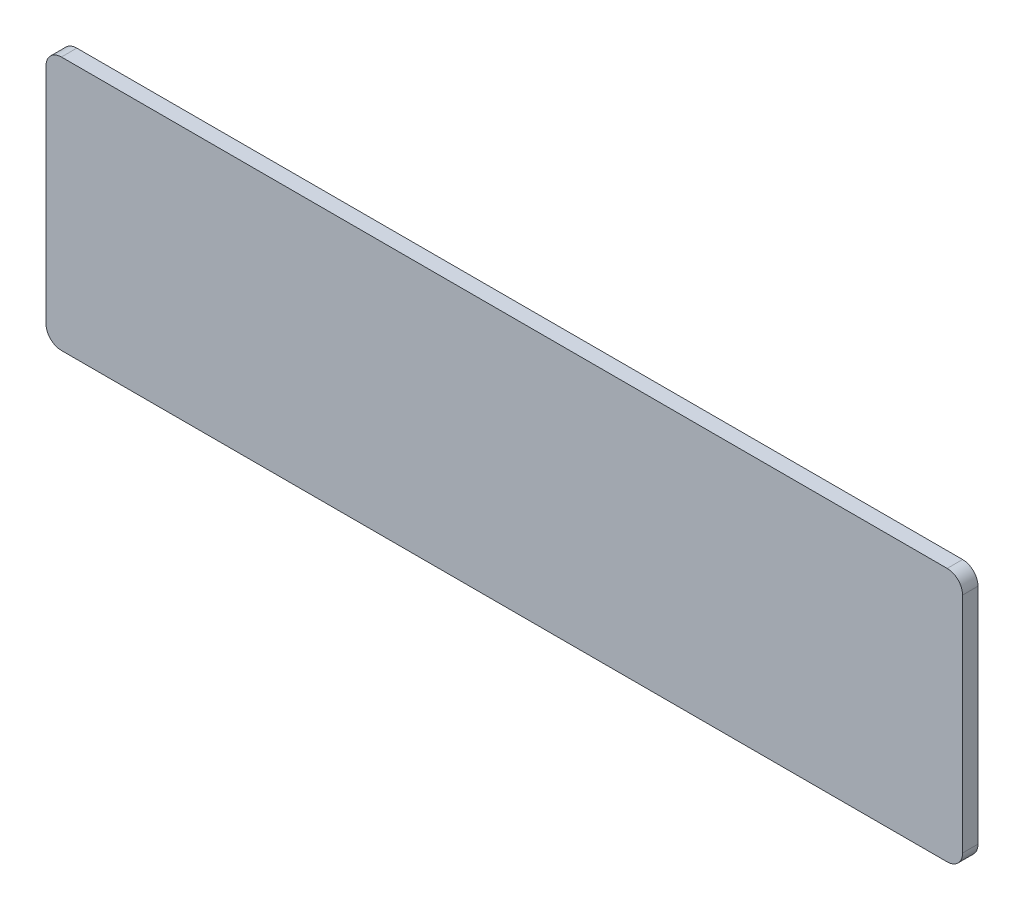
ISO-10303-21;
HEADER;
FILE_DESCRIPTION(('STEP AP214'),'2;1');
FILE_NAME('part.step','',(''),(''),'','','');
FILE_SCHEMA(('AUTOMOTIVE_DESIGN { 1 0 10303 214 1 1 1 1 }'));
ENDSEC;
DATA;
#1=APPLICATION_CONTEXT('core data for automotive mechanical design processes');
#2=APPLICATION_PROTOCOL_DEFINITION('international standard','automotive_design',2000,#1);
#3=PRODUCT_CONTEXT('',#1,'mechanical');
#4=PRODUCT('Part','Part','',(#3));
#5=PRODUCT_RELATED_PRODUCT_CATEGORY('part','',(#4));
#6=PRODUCT_DEFINITION_FORMATION('','',#4);
#7=PRODUCT_DEFINITION_CONTEXT('part definition',#1,'design');
#8=PRODUCT_DEFINITION('design','',#6,#7);
#9=PRODUCT_DEFINITION_SHAPE('','',#8);
#10=(LENGTH_UNIT() NAMED_UNIT(*) SI_UNIT(.MILLI.,.METRE.));
#11=(NAMED_UNIT(*) PLANE_ANGLE_UNIT() SI_UNIT($,.RADIAN.));
#12=(NAMED_UNIT(*) SI_UNIT($,.STERADIAN.) SOLID_ANGLE_UNIT());
#13=UNCERTAINTY_MEASURE_WITH_UNIT(LENGTH_MEASURE(1.E-05),#10,'distance_accuracy_value','');
#14=(GEOMETRIC_REPRESENTATION_CONTEXT(3) GLOBAL_UNCERTAINTY_ASSIGNED_CONTEXT((#13)) GLOBAL_UNIT_ASSIGNED_CONTEXT((#10,
#11,#12)) REPRESENTATION_CONTEXT('',''));
#15=CARTESIAN_POINT('',(0.,0.,0.));
#16=DIRECTION('',(0.,0.,1.));
#17=DIRECTION('',(1.,0.,0.));
#18=AXIS2_PLACEMENT_3D('',#15,#16,#17);
#19=CARTESIAN_POINT('',(57.5,-14.5,0.));
#20=DIRECTION('',(0.,0.,1.));
#21=DIRECTION('',(1.,0.,0.));
#22=AXIS2_PLACEMENT_3D('',#19,#20,#21);
#23=PLANE('',#22);
#24=CARTESIAN_POINT('',(57.5,-14.5,0.));
#25=DIRECTION('',(0.,0.,1.));
#26=DIRECTION('',(1.,0.,0.));
#27=AXIS2_PLACEMENT_3D('',#24,#25,#26);
#28=CIRCLE('',#27,2.);
#29=CARTESIAN_POINT('',(57.5,-16.5,0.));
#30=VERTEX_POINT('',#29);
#31=CARTESIAN_POINT('',(59.5,-14.5,0.));
#32=VERTEX_POINT('',#31);
#33=EDGE_CURVE('E167',#30,#32,#28,.T.);
#34=ORIENTED_EDGE('',*,*,#33,.F.);
#35=DIRECTION('',(1.,0.,0.));
#36=VECTOR('',#35,1.);
#37=CARTESIAN_POINT('',(-57.5,-16.5,0.));
#38=LINE('',#37,#36);
#39=CARTESIAN_POINT('',(-57.5,-16.5,0.));
#40=VERTEX_POINT('',#39);
#41=EDGE_CURVE('E180',#40,#30,#38,.T.);
#42=ORIENTED_EDGE('',*,*,#41,.F.);
#43=CARTESIAN_POINT('',(-57.5,-14.5,0.));
#44=DIRECTION('',(0.,0.,1.));
#45=DIRECTION('',(1.,0.,0.));
#46=AXIS2_PLACEMENT_3D('',#43,#44,#45);
#47=CIRCLE('',#46,2.00000000000002);
#48=CARTESIAN_POINT('',(-59.5,-14.5,0.));
#49=VERTEX_POINT('',#48);
#50=EDGE_CURVE('E204',#49,#40,#47,.T.);
#51=ORIENTED_EDGE('',*,*,#50,.F.);
#52=DIRECTION('',(0.,-1.,0.));
#53=VECTOR('',#52,1.);
#54=CARTESIAN_POINT('',(-59.5,14.5,0.));
#55=LINE('',#54,#53);
#56=CARTESIAN_POINT('',(-59.5,14.5,0.));
#57=VERTEX_POINT('',#56);
#58=EDGE_CURVE('E202',#57,#49,#55,.T.);
#59=ORIENTED_EDGE('',*,*,#58,.F.);
#60=CARTESIAN_POINT('',(-57.5,14.5,0.));
#61=DIRECTION('',(0.,0.,1.));
#62=DIRECTION('',(1.,0.,0.));
#63=AXIS2_PLACEMENT_3D('',#60,#61,#62);
#64=CIRCLE('',#63,2.00000000000002);
#65=CARTESIAN_POINT('',(-57.5,16.5,0.));
#66=VERTEX_POINT('',#65);
#67=EDGE_CURVE('E200',#66,#57,#64,.T.);
#68=ORIENTED_EDGE('',*,*,#67,.F.);
#69=DIRECTION('',(-1.,0.,0.));
#70=VECTOR('',#69,1.);
#71=CARTESIAN_POINT('',(57.5,16.5,0.));
#72=LINE('',#71,#70);
#73=CARTESIAN_POINT('',(57.5,16.5,0.));
#74=VERTEX_POINT('',#73);
#75=EDGE_CURVE('E198',#74,#66,#72,.T.);
#76=ORIENTED_EDGE('',*,*,#75,.F.);
#77=CARTESIAN_POINT('',(57.5,14.5,0.));
#78=DIRECTION('',(0.,0.,1.));
#79=DIRECTION('',(1.,0.,0.));
#80=AXIS2_PLACEMENT_3D('',#77,#78,#79);
#81=CIRCLE('',#80,2.);
#82=CARTESIAN_POINT('',(59.5,14.5,0.));
#83=VERTEX_POINT('',#82);
#84=EDGE_CURVE('E196',#83,#74,#81,.T.);
#85=ORIENTED_EDGE('',*,*,#84,.F.);
#86=DIRECTION('',(0.,1.,0.));
#87=VECTOR('',#86,1.);
#88=CARTESIAN_POINT('',(59.5,-14.5,0.));
#89=LINE('',#88,#87);
#90=EDGE_CURVE('E170',#32,#83,#89,.T.);
#91=ORIENTED_EDGE('',*,*,#90,.F.);
#92=EDGE_LOOP('',(#34,#42,#51,#59,#68,#76,#85,#91));
#93=FACE_BOUND('',#92,.T.);
#94=CARTESIAN_POINT('',(53.,9.99999999999998,0.));
#95=DIRECTION('',(0.,0.,-1.));
#96=DIRECTION('',(-1.,0.,0.));
#97=AXIS2_PLACEMENT_3D('',#94,#95,#96);
#98=CIRCLE('',#97,2.);
#99=CARTESIAN_POINT('',(53.,12.,0.));
#100=VERTEX_POINT('',#99);
#101=CARTESIAN_POINT('',(55.,9.99999999999997,0.));
#102=VERTEX_POINT('',#101);
#103=EDGE_CURVE('E49',#100,#102,#98,.T.);
#104=ORIENTED_EDGE('',*,*,#103,.F.);
#105=DIRECTION('',(1.,0.,0.));
#106=VECTOR('',#105,1.);
#107=CARTESIAN_POINT('',(-53.,12.,0.));
#108=LINE('',#107,#106);
#109=CARTESIAN_POINT('',(-53.,12.,0.));
#110=VERTEX_POINT('',#109);
#111=EDGE_CURVE('E53',#110,#100,#108,.T.);
#112=ORIENTED_EDGE('',*,*,#111,.F.);
#113=CARTESIAN_POINT('',(-53.,10.,0.));
#114=DIRECTION('',(0.,0.,-1.));
#115=DIRECTION('',(-1.,0.,0.));
#116=AXIS2_PLACEMENT_3D('',#113,#114,#115);
#117=CIRCLE('',#116,2.);
#118=CARTESIAN_POINT('',(-55.,9.99999999999998,0.));
#119=VERTEX_POINT('',#118);
#120=EDGE_CURVE('E430',#119,#110,#117,.T.);
#121=ORIENTED_EDGE('',*,*,#120,.F.);
#122=DIRECTION('',(0.,1.,0.));
#123=VECTOR('',#122,1.);
#124=CARTESIAN_POINT('',(-55.,-9.99999999999999,0.));
#125=LINE('',#124,#123);
#126=CARTESIAN_POINT('',(-55.,-9.99999999999999,0.));
#127=VERTEX_POINT('',#126);
#128=EDGE_CURVE('E464',#127,#119,#125,.T.);
#129=ORIENTED_EDGE('',*,*,#128,.F.);
#130=CARTESIAN_POINT('',(-53.,-10.,0.));
#131=DIRECTION('',(0.,0.,-1.));
#132=DIRECTION('',(-1.,0.,0.));
#133=AXIS2_PLACEMENT_3D('',#130,#131,#132);
#134=CIRCLE('',#133,2.);
#135=CARTESIAN_POINT('',(-53.,-12.,0.));
#136=VERTEX_POINT('',#135);
#137=EDGE_CURVE('E457',#136,#127,#134,.T.);
#138=ORIENTED_EDGE('',*,*,#137,.F.);
#139=DIRECTION('',(-1.,0.,0.));
#140=VECTOR('',#139,1.);
#141=CARTESIAN_POINT('',(-53.,-12.,0.));
#142=LINE('',#141,#140);
#143=CARTESIAN_POINT('',(53.,-12.,0.));
#144=VERTEX_POINT('',#143);
#145=EDGE_CURVE('E451',#144,#136,#142,.T.);
#146=ORIENTED_EDGE('',*,*,#145,.F.);
#147=CARTESIAN_POINT('',(53.,-10.,0.));
#148=DIRECTION('',(0.,0.,-1.));
#149=DIRECTION('',(1.,0.,0.));
#150=AXIS2_PLACEMENT_3D('',#147,#148,#149);
#151=CIRCLE('',#150,2.);
#152=CARTESIAN_POINT('',(55.,-10.,0.));
#153=VERTEX_POINT('',#152);
#154=EDGE_CURVE('E454',#153,#144,#151,.T.);
#155=ORIENTED_EDGE('',*,*,#154,.F.);
#156=DIRECTION('',(0.,-1.,0.));
#157=VECTOR('',#156,1.);
#158=CARTESIAN_POINT('',(55.,-10.,0.));
#159=LINE('',#158,#157);
#160=EDGE_CURVE('E455',#102,#153,#159,.T.);
#161=ORIENTED_EDGE('',*,*,#160,.F.);
#162=EDGE_LOOP('',(#104,#112,#121,#129,#138,#146,#155,#161));
#163=FACE_BOUND('',#162,.T.);
#164=ADVANCED_FACE('F34',(#93,#163),#23,.F.);
#165=CARTESIAN_POINT('',(57.5,-14.5,2.));
#166=DIRECTION('',(0.,0.,-1.));
#167=DIRECTION('',(-1.,0.,0.));
#168=AXIS2_PLACEMENT_3D('',#165,#166,#167);
#169=CYLINDRICAL_SURFACE('',#168,2.);
#170=ORIENTED_EDGE('',*,*,#33,.T.);
#171=DIRECTION('',(0.,0.,-1.));
#172=VECTOR('',#171,1.);
#173=CARTESIAN_POINT('',(59.5,-14.5,2.));
#174=LINE('',#173,#172);
#175=CARTESIAN_POINT('',(59.5,-14.5,2.));
#176=VERTEX_POINT('',#175);
#177=EDGE_CURVE('E11',#176,#32,#174,.T.);
#178=ORIENTED_EDGE('',*,*,#177,.F.);
#179=CARTESIAN_POINT('',(57.5,-14.5,2.));
#180=DIRECTION('',(0.,0.,1.));
#181=DIRECTION('',(1.,0.,0.));
#182=AXIS2_PLACEMENT_3D('',#179,#180,#181);
#183=CIRCLE('',#182,2.);
#184=CARTESIAN_POINT('',(57.5,-16.5,2.));
#185=VERTEX_POINT('',#184);
#186=EDGE_CURVE('E176',#185,#176,#183,.T.);
#187=ORIENTED_EDGE('',*,*,#186,.F.);
#188=DIRECTION('',(0.,0.,-1.));
#189=VECTOR('',#188,1.);
#190=CARTESIAN_POINT('',(57.5,-16.5,2.));
#191=LINE('',#190,#189);
#192=EDGE_CURVE('E193',#185,#30,#191,.T.);
#193=ORIENTED_EDGE('',*,*,#192,.T.);
#194=EDGE_LOOP('',(#170,#178,#187,#193));
#195=FACE_BOUND('',#194,.T.);
#196=ADVANCED_FACE('F36',(#195),#169,.T.);
#197=CARTESIAN_POINT('',(59.5,-14.5,2.));
#198=DIRECTION('',(-1.,0.,0.));
#199=DIRECTION('',(0.,0.,1.));
#200=AXIS2_PLACEMENT_3D('',#197,#198,#199);
#201=PLANE('',#200);
#202=ORIENTED_EDGE('',*,*,#90,.T.);
#203=DIRECTION('',(0.,0.,-1.));
#204=VECTOR('',#203,1.);
#205=CARTESIAN_POINT('',(59.5,14.5,2.));
#206=LINE('',#205,#204);
#207=CARTESIAN_POINT('',(59.5,14.5,2.));
#208=VERTEX_POINT('',#207);
#209=EDGE_CURVE('E42',#208,#83,#206,.T.);
#210=ORIENTED_EDGE('',*,*,#209,.F.);
#211=DIRECTION('',(0.,1.,0.));
#212=VECTOR('',#211,1.);
#213=CARTESIAN_POINT('',(59.5,-14.5,2.));
#214=LINE('',#213,#212);
#215=EDGE_CURVE('E179',#176,#208,#214,.T.);
#216=ORIENTED_EDGE('',*,*,#215,.F.);
#217=ORIENTED_EDGE('',*,*,#177,.T.);
#218=EDGE_LOOP('',(#202,#210,#216,#217));
#219=FACE_BOUND('',#218,.T.);
#220=ADVANCED_FACE('F250',(#219),#201,.F.);
#221=CARTESIAN_POINT('',(57.5,14.5,2.));
#222=DIRECTION('',(0.,0.,-1.));
#223=DIRECTION('',(-1.,0.,0.));
#224=AXIS2_PLACEMENT_3D('',#221,#222,#223);
#225=CYLINDRICAL_SURFACE('',#224,2.);
#226=ORIENTED_EDGE('',*,*,#84,.T.);
#227=DIRECTION('',(0.,0.,-1.));
#228=VECTOR('',#227,1.);
#229=CARTESIAN_POINT('',(57.5,16.5,2.));
#230=LINE('',#229,#228);
#231=CARTESIAN_POINT('',(57.5,16.5,2.));
#232=VERTEX_POINT('',#231);
#233=EDGE_CURVE('E221',#232,#74,#230,.T.);
#234=ORIENTED_EDGE('',*,*,#233,.F.);
#235=CARTESIAN_POINT('',(57.5,14.5,2.));
#236=DIRECTION('',(0.,0.,1.));
#237=DIRECTION('',(1.,0.,0.));
#238=AXIS2_PLACEMENT_3D('',#235,#236,#237);
#239=CIRCLE('',#238,2.);
#240=EDGE_CURVE('E182',#208,#232,#239,.T.);
#241=ORIENTED_EDGE('',*,*,#240,.F.);
#242=ORIENTED_EDGE('',*,*,#209,.T.);
#243=EDGE_LOOP('',(#226,#234,#241,#242));
#244=FACE_BOUND('',#243,.T.);
#245=ADVANCED_FACE('F228',(#244),#225,.T.);
#246=CARTESIAN_POINT('',(57.5,16.5,2.));
#247=DIRECTION('',(0.,-1.,0.));
#248=DIRECTION('',(0.,0.,-1.));
#249=AXIS2_PLACEMENT_3D('',#246,#247,#248);
#250=PLANE('',#249);
#251=ORIENTED_EDGE('',*,*,#75,.T.);
#252=DIRECTION('',(0.,0.,-1.));
#253=VECTOR('',#252,1.);
#254=CARTESIAN_POINT('',(-57.5,16.5,2.));
#255=LINE('',#254,#253);
#256=CARTESIAN_POINT('',(-57.5,16.5,2.));
#257=VERTEX_POINT('',#256);
#258=EDGE_CURVE('E218',#257,#66,#255,.T.);
#259=ORIENTED_EDGE('',*,*,#258,.F.);
#260=DIRECTION('',(-1.,0.,0.));
#261=VECTOR('',#260,1.);
#262=CARTESIAN_POINT('',(57.5,16.5,2.));
#263=LINE('',#262,#261);
#264=EDGE_CURVE('E184',#232,#257,#263,.T.);
#265=ORIENTED_EDGE('',*,*,#264,.F.);
#266=ORIENTED_EDGE('',*,*,#233,.T.);
#267=EDGE_LOOP('',(#251,#259,#265,#266));
#268=FACE_BOUND('',#267,.T.);
#269=ADVANCED_FACE('F238',(#268),#250,.F.);
#270=CARTESIAN_POINT('',(-57.5,14.5,2.));
#271=DIRECTION('',(0.,0.,-1.));
#272=DIRECTION('',(-1.,0.,0.));
#273=AXIS2_PLACEMENT_3D('',#270,#271,#272);
#274=CYLINDRICAL_SURFACE('',#273,2.00000000000002);
#275=ORIENTED_EDGE('',*,*,#67,.T.);
#276=DIRECTION('',(0.,0.,-1.));
#277=VECTOR('',#276,1.);
#278=CARTESIAN_POINT('',(-59.5,14.5,2.));
#279=LINE('',#278,#277);
#280=CARTESIAN_POINT('',(-59.5,14.5,2.));
#281=VERTEX_POINT('',#280);
#282=EDGE_CURVE('E215',#281,#57,#279,.T.);
#283=ORIENTED_EDGE('',*,*,#282,.F.);
#284=CARTESIAN_POINT('',(-57.5,14.5,2.));
#285=DIRECTION('',(0.,0.,1.));
#286=DIRECTION('',(1.,0.,0.));
#287=AXIS2_PLACEMENT_3D('',#284,#285,#286);
#288=CIRCLE('',#287,2.00000000000002);
#289=EDGE_CURVE('E186',#257,#281,#288,.T.);
#290=ORIENTED_EDGE('',*,*,#289,.F.);
#291=ORIENTED_EDGE('',*,*,#258,.T.);
#292=EDGE_LOOP('',(#275,#283,#290,#291));
#293=FACE_BOUND('',#292,.T.);
#294=ADVANCED_FACE('F242',(#293),#274,.T.);
#295=CARTESIAN_POINT('',(-59.5,14.5,2.));
#296=DIRECTION('',(1.,0.,0.));
#297=DIRECTION('',(0.,0.,-1.));
#298=AXIS2_PLACEMENT_3D('',#295,#296,#297);
#299=PLANE('',#298);
#300=ORIENTED_EDGE('',*,*,#58,.T.);
#301=DIRECTION('',(0.,0.,-1.));
#302=VECTOR('',#301,1.);
#303=CARTESIAN_POINT('',(-59.5,-14.5,2.));
#304=LINE('',#303,#302);
#305=CARTESIAN_POINT('',(-59.5,-14.5,2.));
#306=VERTEX_POINT('',#305);
#307=EDGE_CURVE('E212',#306,#49,#304,.T.);
#308=ORIENTED_EDGE('',*,*,#307,.F.);
#309=DIRECTION('',(0.,-1.,0.));
#310=VECTOR('',#309,1.);
#311=CARTESIAN_POINT('',(-59.5,14.5,2.));
#312=LINE('',#311,#310);
#313=EDGE_CURVE('E188',#281,#306,#312,.T.);
#314=ORIENTED_EDGE('',*,*,#313,.F.);
#315=ORIENTED_EDGE('',*,*,#282,.T.);
#316=EDGE_LOOP('',(#300,#308,#314,#315));
#317=FACE_BOUND('',#316,.T.);
#318=ADVANCED_FACE('F263',(#317),#299,.F.);
#319=CARTESIAN_POINT('',(-57.5,-14.5,2.));
#320=DIRECTION('',(0.,0.,-1.));
#321=DIRECTION('',(-1.,0.,0.));
#322=AXIS2_PLACEMENT_3D('',#319,#320,#321);
#323=CYLINDRICAL_SURFACE('',#322,2.00000000000002);
#324=ORIENTED_EDGE('',*,*,#50,.T.);
#325=DIRECTION('',(0.,0.,-1.));
#326=VECTOR('',#325,1.);
#327=CARTESIAN_POINT('',(-57.5,-16.5,2.));
#328=LINE('',#327,#326);
#329=CARTESIAN_POINT('',(-57.5,-16.5,2.));
#330=VERTEX_POINT('',#329);
#331=EDGE_CURVE('E209',#330,#40,#328,.T.);
#332=ORIENTED_EDGE('',*,*,#331,.F.);
#333=CARTESIAN_POINT('',(-57.5,-14.5,2.));
#334=DIRECTION('',(0.,0.,1.));
#335=DIRECTION('',(1.,0.,0.));
#336=AXIS2_PLACEMENT_3D('',#333,#334,#335);
#337=CIRCLE('',#336,2.00000000000002);
#338=EDGE_CURVE('E190',#306,#330,#337,.T.);
#339=ORIENTED_EDGE('',*,*,#338,.F.);
#340=ORIENTED_EDGE('',*,*,#307,.T.);
#341=EDGE_LOOP('',(#324,#332,#339,#340));
#342=FACE_BOUND('',#341,.T.);
#343=ADVANCED_FACE('F261',(#342),#323,.T.);
#344=CARTESIAN_POINT('',(-57.5,-16.5,2.));
#345=DIRECTION('',(0.,1.,0.));
#346=DIRECTION('',(0.,0.,1.));
#347=AXIS2_PLACEMENT_3D('',#344,#345,#346);
#348=PLANE('',#347);
#349=ORIENTED_EDGE('',*,*,#41,.T.);
#350=ORIENTED_EDGE('',*,*,#192,.F.);
#351=DIRECTION('',(1.,0.,0.));
#352=VECTOR('',#351,1.);
#353=CARTESIAN_POINT('',(-57.5,-16.5,2.));
#354=LINE('',#353,#352);
#355=EDGE_CURVE('E192',#330,#185,#354,.T.);
#356=ORIENTED_EDGE('',*,*,#355,.F.);
#357=ORIENTED_EDGE('',*,*,#331,.T.);
#358=EDGE_LOOP('',(#349,#350,#356,#357));
#359=FACE_BOUND('',#358,.T.);
#360=ADVANCED_FACE('F256',(#359),#348,.F.);
#361=CARTESIAN_POINT('',(57.5,-14.5,2.));
#362=DIRECTION('',(0.,0.,1.));
#363=DIRECTION('',(1.,0.,0.));
#364=AXIS2_PLACEMENT_3D('',#361,#362,#363);
#365=PLANE('',#364);
#366=ORIENTED_EDGE('',*,*,#186,.T.);
#367=ORIENTED_EDGE('',*,*,#215,.T.);
#368=ORIENTED_EDGE('',*,*,#240,.T.);
#369=ORIENTED_EDGE('',*,*,#264,.T.);
#370=ORIENTED_EDGE('',*,*,#289,.T.);
#371=ORIENTED_EDGE('',*,*,#313,.T.);
#372=ORIENTED_EDGE('',*,*,#338,.T.);
#373=ORIENTED_EDGE('',*,*,#355,.T.);
#374=EDGE_LOOP('',(#366,#367,#368,#369,#370,#371,#372,#373));
#375=FACE_BOUND('',#374,.T.);
#376=ADVANCED_FACE('F246',(#375),#365,.T.);
#377=CARTESIAN_POINT('',(53.,9.99999999999998,-1.));
#378=DIRECTION('',(0.,0.,1.));
#379=DIRECTION('',(1.,0.,0.));
#380=AXIS2_PLACEMENT_3D('',#377,#378,#379);
#381=CYLINDRICAL_SURFACE('',#380,2.);
#382=ORIENTED_EDGE('',*,*,#103,.T.);
#383=DIRECTION('',(0.,0.,1.));
#384=VECTOR('',#383,1.);
#385=CARTESIAN_POINT('',(55.,9.99999999999997,-1.));
#386=LINE('',#385,#384);
#387=CARTESIAN_POINT('',(55.,9.99999999999997,-1.));
#388=VERTEX_POINT('',#387);
#389=EDGE_CURVE('E150',#388,#102,#386,.T.);
#390=ORIENTED_EDGE('',*,*,#389,.F.);
#391=CARTESIAN_POINT('',(53.,9.99999999999998,-1.));
#392=DIRECTION('',(0.,0.,-1.));
#393=DIRECTION('',(-1.,0.,0.));
#394=AXIS2_PLACEMENT_3D('',#391,#392,#393);
#395=CIRCLE('',#394,2.);
#396=CARTESIAN_POINT('',(53.,12.,-1.));
#397=VERTEX_POINT('',#396);
#398=EDGE_CURVE('E156',#397,#388,#395,.T.);
#399=ORIENTED_EDGE('',*,*,#398,.F.);
#400=DIRECTION('',(0.,0.,1.));
#401=VECTOR('',#400,1.);
#402=CARTESIAN_POINT('',(53.,12.,-1.));
#403=LINE('',#402,#401);
#404=EDGE_CURVE('E427',#397,#100,#403,.T.);
#405=ORIENTED_EDGE('',*,*,#404,.T.);
#406=EDGE_LOOP('',(#382,#390,#399,#405));
#407=FACE_BOUND('',#406,.T.);
#408=ADVANCED_FACE('F166',(#407),#381,.T.);
#409=CARTESIAN_POINT('',(55.,-10.,-1.));
#410=DIRECTION('',(-1.,0.,0.));
#411=DIRECTION('',(0.,0.,1.));
#412=AXIS2_PLACEMENT_3D('',#409,#410,#411);
#413=PLANE('',#412);
#414=ORIENTED_EDGE('',*,*,#160,.T.);
#415=DIRECTION('',(0.,0.,1.));
#416=VECTOR('',#415,1.);
#417=CARTESIAN_POINT('',(55.,-10.,-1.));
#418=LINE('',#417,#416);
#419=CARTESIAN_POINT('',(55.,-10.,-1.));
#420=VERTEX_POINT('',#419);
#421=EDGE_CURVE('E152',#420,#153,#418,.T.);
#422=ORIENTED_EDGE('',*,*,#421,.F.);
#423=DIRECTION('',(0.,-1.,0.));
#424=VECTOR('',#423,1.);
#425=CARTESIAN_POINT('',(55.,-10.,-1.));
#426=LINE('',#425,#424);
#427=EDGE_CURVE('E145',#388,#420,#426,.T.);
#428=ORIENTED_EDGE('',*,*,#427,.F.);
#429=ORIENTED_EDGE('',*,*,#389,.T.);
#430=EDGE_LOOP('',(#414,#422,#428,#429));
#431=FACE_BOUND('',#430,.T.);
#432=ADVANCED_FACE('F148',(#431),#413,.F.);
#433=CARTESIAN_POINT('',(53.,-10.,-1.));
#434=DIRECTION('',(0.,0.,1.));
#435=DIRECTION('',(1.,0.,0.));
#436=AXIS2_PLACEMENT_3D('',#433,#434,#435);
#437=CYLINDRICAL_SURFACE('',#436,2.);
#438=ORIENTED_EDGE('',*,*,#154,.T.);
#439=DIRECTION('',(0.,0.,1.));
#440=VECTOR('',#439,1.);
#441=CARTESIAN_POINT('',(53.,-12.,-1.));
#442=LINE('',#441,#440);
#443=CARTESIAN_POINT('',(53.,-12.,-1.));
#444=VERTEX_POINT('',#443);
#445=EDGE_CURVE('E172',#444,#144,#442,.T.);
#446=ORIENTED_EDGE('',*,*,#445,.F.);
#447=CARTESIAN_POINT('',(53.,-10.,-1.));
#448=DIRECTION('',(0.,0.,-1.));
#449=DIRECTION('',(1.,0.,0.));
#450=AXIS2_PLACEMENT_3D('',#447,#448,#449);
#451=CIRCLE('',#450,2.);
#452=EDGE_CURVE('E155',#420,#444,#451,.T.);
#453=ORIENTED_EDGE('',*,*,#452,.F.);
#454=ORIENTED_EDGE('',*,*,#421,.T.);
#455=EDGE_LOOP('',(#438,#446,#453,#454));
#456=FACE_BOUND('',#455,.T.);
#457=ADVANCED_FACE('F290',(#456),#437,.T.);
#458=CARTESIAN_POINT('',(-53.,-12.,-1.));
#459=DIRECTION('',(0.,1.,0.));
#460=DIRECTION('',(-1.,0.,0.));
#461=AXIS2_PLACEMENT_3D('',#458,#459,#460);
#462=PLANE('',#461);
#463=ORIENTED_EDGE('',*,*,#145,.T.);
#464=DIRECTION('',(0.,0.,1.));
#465=VECTOR('',#464,1.);
#466=CARTESIAN_POINT('',(-53.,-12.,-1.));
#467=LINE('',#466,#465);
#468=CARTESIAN_POINT('',(-53.,-12.,-1.));
#469=VERTEX_POINT('',#468);
#470=EDGE_CURVE('E444',#469,#136,#467,.T.);
#471=ORIENTED_EDGE('',*,*,#470,.F.);
#472=DIRECTION('',(-1.,0.,0.));
#473=VECTOR('',#472,1.);
#474=CARTESIAN_POINT('',(-53.,-12.,-1.));
#475=LINE('',#474,#473);
#476=EDGE_CURVE('E452',#444,#469,#475,.T.);
#477=ORIENTED_EDGE('',*,*,#476,.F.);
#478=ORIENTED_EDGE('',*,*,#445,.T.);
#479=EDGE_LOOP('',(#463,#471,#477,#478));
#480=FACE_BOUND('',#479,.T.);
#481=ADVANCED_FACE('F295',(#480),#462,.F.);
#482=CARTESIAN_POINT('',(-53.,-10.,-1.));
#483=DIRECTION('',(0.,0.,1.));
#484=DIRECTION('',(1.,0.,0.));
#485=AXIS2_PLACEMENT_3D('',#482,#483,#484);
#486=CYLINDRICAL_SURFACE('',#485,2.);
#487=ORIENTED_EDGE('',*,*,#137,.T.);
#488=DIRECTION('',(0.,0.,1.));
#489=VECTOR('',#488,1.);
#490=CARTESIAN_POINT('',(-55.,-9.99999999999999,-1.));
#491=LINE('',#490,#489);
#492=CARTESIAN_POINT('',(-55.,-9.99999999999999,-1.));
#493=VERTEX_POINT('',#492);
#494=EDGE_CURVE('E441',#493,#127,#491,.T.);
#495=ORIENTED_EDGE('',*,*,#494,.F.);
#496=CARTESIAN_POINT('',(-53.,-10.,-1.));
#497=DIRECTION('',(0.,0.,-1.));
#498=DIRECTION('',(-1.,0.,0.));
#499=AXIS2_PLACEMENT_3D('',#496,#497,#498);
#500=CIRCLE('',#499,2.);
#501=EDGE_CURVE('E472',#469,#493,#500,.T.);
#502=ORIENTED_EDGE('',*,*,#501,.F.);
#503=ORIENTED_EDGE('',*,*,#470,.T.);
#504=EDGE_LOOP('',(#487,#495,#502,#503));
#505=FACE_BOUND('',#504,.T.);
#506=ADVANCED_FACE('F299',(#505),#486,.T.);
#507=CARTESIAN_POINT('',(-55.,-9.99999999999999,-1.));
#508=DIRECTION('',(1.,0.,0.));
#509=DIRECTION('',(0.,0.,-1.));
#510=AXIS2_PLACEMENT_3D('',#507,#508,#509);
#511=PLANE('',#510);
#512=ORIENTED_EDGE('',*,*,#128,.T.);
#513=DIRECTION('',(0.,0.,1.));
#514=VECTOR('',#513,1.);
#515=CARTESIAN_POINT('',(-55.,9.99999999999998,-1.));
#516=LINE('',#515,#514);
#517=CARTESIAN_POINT('',(-55.,9.99999999999998,-1.));
#518=VERTEX_POINT('',#517);
#519=EDGE_CURVE('E433',#518,#119,#516,.T.);
#520=ORIENTED_EDGE('',*,*,#519,.F.);
#521=DIRECTION('',(0.,1.,0.));
#522=VECTOR('',#521,1.);
#523=CARTESIAN_POINT('',(-55.,-9.99999999999999,-1.));
#524=LINE('',#523,#522);
#525=EDGE_CURVE('E470',#493,#518,#524,.T.);
#526=ORIENTED_EDGE('',*,*,#525,.F.);
#527=ORIENTED_EDGE('',*,*,#494,.T.);
#528=EDGE_LOOP('',(#512,#520,#526,#527));
#529=FACE_BOUND('',#528,.T.);
#530=ADVANCED_FACE('F303',(#529),#511,.F.);
#531=CARTESIAN_POINT('',(-53.,10.,-1.));
#532=DIRECTION('',(0.,0.,1.));
#533=DIRECTION('',(1.,0.,0.));
#534=AXIS2_PLACEMENT_3D('',#531,#532,#533);
#535=CYLINDRICAL_SURFACE('',#534,2.);
#536=ORIENTED_EDGE('',*,*,#120,.T.);
#537=DIRECTION('',(0.,0.,1.));
#538=VECTOR('',#537,1.);
#539=CARTESIAN_POINT('',(-53.,12.,-1.));
#540=LINE('',#539,#538);
#541=CARTESIAN_POINT('',(-53.,12.,-1.));
#542=VERTEX_POINT('',#541);
#543=EDGE_CURVE('E429',#542,#110,#540,.T.);
#544=ORIENTED_EDGE('',*,*,#543,.F.);
#545=CARTESIAN_POINT('',(-53.,10.,-1.));
#546=DIRECTION('',(0.,0.,-1.));
#547=DIRECTION('',(-1.,0.,0.));
#548=AXIS2_PLACEMENT_3D('',#545,#546,#547);
#549=CIRCLE('',#548,2.);
#550=EDGE_CURVE('E435',#518,#542,#549,.T.);
#551=ORIENTED_EDGE('',*,*,#550,.F.);
#552=ORIENTED_EDGE('',*,*,#519,.T.);
#553=EDGE_LOOP('',(#536,#544,#551,#552));
#554=FACE_BOUND('',#553,.T.);
#555=ADVANCED_FACE('F307',(#554),#535,.T.);
#556=CARTESIAN_POINT('',(-53.,12.,-1.));
#557=DIRECTION('',(0.,-1.,0.));
#558=DIRECTION('',(1.,0.,0.));
#559=AXIS2_PLACEMENT_3D('',#556,#557,#558);
#560=PLANE('',#559);
#561=ORIENTED_EDGE('',*,*,#111,.T.);
#562=ORIENTED_EDGE('',*,*,#404,.F.);
#563=DIRECTION('',(1.,0.,0.));
#564=VECTOR('',#563,1.);
#565=CARTESIAN_POINT('',(-53.,12.,-1.));
#566=LINE('',#565,#564);
#567=EDGE_CURVE('E161',#542,#397,#566,.T.);
#568=ORIENTED_EDGE('',*,*,#567,.F.);
#569=ORIENTED_EDGE('',*,*,#543,.T.);
#570=EDGE_LOOP('',(#561,#562,#568,#569));
#571=FACE_BOUND('',#570,.T.);
#572=ADVANCED_FACE('F311',(#571),#560,.F.);
#573=CARTESIAN_POINT('',(53.,9.99999999999998,-1.));
#574=DIRECTION('',(0.,0.,-1.));
#575=DIRECTION('',(-1.,0.,0.));
#576=AXIS2_PLACEMENT_3D('',#573,#574,#575);
#577=PLANE('',#576);
#578=ORIENTED_EDGE('',*,*,#398,.T.);
#579=ORIENTED_EDGE('',*,*,#427,.T.);
#580=ORIENTED_EDGE('',*,*,#452,.T.);
#581=ORIENTED_EDGE('',*,*,#476,.T.);
#582=ORIENTED_EDGE('',*,*,#501,.T.);
#583=ORIENTED_EDGE('',*,*,#525,.T.);
#584=ORIENTED_EDGE('',*,*,#550,.T.);
#585=ORIENTED_EDGE('',*,*,#567,.T.);
#586=EDGE_LOOP('',(#578,#579,#580,#581,#582,#583,#584,#585));
#587=FACE_BOUND('',#586,.T.);
#588=ADVANCED_FACE('F159',(#587),#577,.T.);
#589=CLOSED_SHELL('',(#164,#196,#220,#245,#269,#294,#318,#343,#360,#376,#408,#432,#457,#481,
#506,#530,#555,#572,#588));
#590=MANIFOLD_SOLID_BREP('B2',#589);
#591=ADVANCED_BREP_SHAPE_REPRESENTATION('',(#18,#590),#14);
#592=SHAPE_DEFINITION_REPRESENTATION(#9,#591);
ENDSEC;
END-ISO-10303-21;
